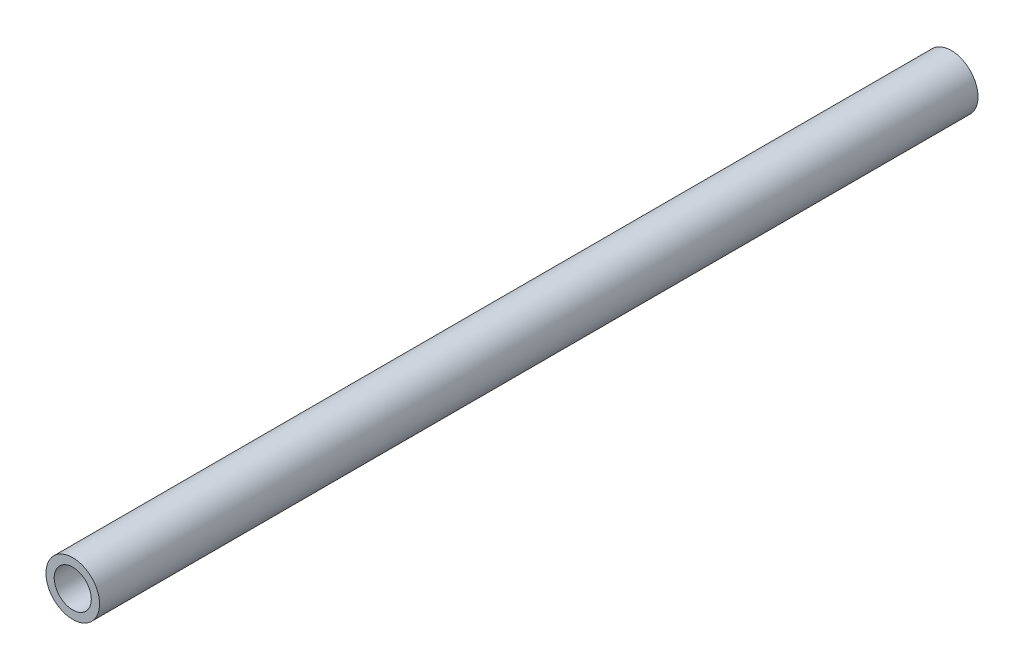
ISO-10303-21;
HEADER;
FILE_DESCRIPTION(('STEP AP214'),'2;1');
FILE_NAME('part.step','',(''),(''),'','','');
FILE_SCHEMA(('AUTOMOTIVE_DESIGN { 1 0 10303 214 1 1 1 1 }'));
ENDSEC;
DATA;
#1=APPLICATION_CONTEXT('core data for automotive mechanical design processes');
#2=APPLICATION_PROTOCOL_DEFINITION('international standard','automotive_design',2000,#1);
#3=PRODUCT_CONTEXT('',#1,'mechanical');
#4=PRODUCT('Part','Part','',(#3));
#5=PRODUCT_RELATED_PRODUCT_CATEGORY('part','',(#4));
#6=PRODUCT_DEFINITION_FORMATION('','',#4);
#7=PRODUCT_DEFINITION_CONTEXT('part definition',#1,'design');
#8=PRODUCT_DEFINITION('design','',#6,#7);
#9=PRODUCT_DEFINITION_SHAPE('','',#8);
#10=(LENGTH_UNIT() NAMED_UNIT(*) SI_UNIT(.MILLI.,.METRE.));
#11=(NAMED_UNIT(*) PLANE_ANGLE_UNIT() SI_UNIT($,.RADIAN.));
#12=(NAMED_UNIT(*) SI_UNIT($,.STERADIAN.) SOLID_ANGLE_UNIT());
#13=UNCERTAINTY_MEASURE_WITH_UNIT(LENGTH_MEASURE(1.E-05),#10,'distance_accuracy_value','');
#14=(GEOMETRIC_REPRESENTATION_CONTEXT(3) GLOBAL_UNCERTAINTY_ASSIGNED_CONTEXT((#13)) GLOBAL_UNIT_ASSIGNED_CONTEXT((#10,
#11,#12)) REPRESENTATION_CONTEXT('',''));
#15=CARTESIAN_POINT('',(0.,0.,0.));
#16=DIRECTION('',(0.,0.,1.));
#17=DIRECTION('',(1.,0.,0.));
#18=AXIS2_PLACEMENT_3D('',#15,#16,#17);
#19=CARTESIAN_POINT('',(0.,0.,254.));
#20=DIRECTION('',(0.,0.,1.));
#21=DIRECTION('',(1.,0.,0.));
#22=AXIS2_PLACEMENT_3D('',#19,#20,#21);
#23=PLANE('',#22);
#24=CARTESIAN_POINT('',(0.,0.,254.));
#25=DIRECTION('',(0.,0.,1.));
#26=DIRECTION('',(1.,0.,0.));
#27=AXIS2_PLACEMENT_3D('',#24,#25,#26);
#28=CIRCLE('',#27,7.747);
#29=CARTESIAN_POINT('',(7.747,0.,254.));
#30=VERTEX_POINT('',#29);
#31=EDGE_CURVE('E10',#30,#30,#28,.T.);
#32=ORIENTED_EDGE('',*,*,#31,.T.);
#33=EDGE_LOOP('',(#32));
#34=FACE_BOUND('',#33,.T.);
#35=CARTESIAN_POINT('',(0.,0.,254.));
#36=DIRECTION('',(0.,0.,1.));
#37=DIRECTION('',(1.,0.,0.));
#38=AXIS2_PLACEMENT_3D('',#35,#36,#37);
#39=CIRCLE('',#38,5.3594);
#40=CARTESIAN_POINT('',(5.3594,0.,254.));
#41=VERTEX_POINT('',#40);
#42=EDGE_CURVE('E41',#41,#41,#39,.T.);
#43=ORIENTED_EDGE('',*,*,#42,.F.);
#44=EDGE_LOOP('',(#43));
#45=FACE_BOUND('',#44,.T.);
#46=ADVANCED_FACE('F30',(#34,#45),#23,.T.);
#47=CARTESIAN_POINT('',(0.,0.,0.));
#48=DIRECTION('',(0.,0.,1.));
#49=DIRECTION('',(1.,0.,0.));
#50=AXIS2_PLACEMENT_3D('',#47,#48,#49);
#51=PLANE('',#50);
#52=CARTESIAN_POINT('',(0.,0.,0.));
#53=DIRECTION('',(0.,0.,1.));
#54=DIRECTION('',(1.,0.,0.));
#55=AXIS2_PLACEMENT_3D('',#52,#53,#54);
#56=CIRCLE('',#55,7.747);
#57=CARTESIAN_POINT('',(7.747,0.,0.));
#58=VERTEX_POINT('',#57);
#59=EDGE_CURVE('E34',#58,#58,#56,.T.);
#60=ORIENTED_EDGE('',*,*,#59,.F.);
#61=EDGE_LOOP('',(#60));
#62=FACE_BOUND('',#61,.T.);
#63=CARTESIAN_POINT('',(0.,0.,0.));
#64=DIRECTION('',(0.,0.,1.));
#65=DIRECTION('',(1.,0.,0.));
#66=AXIS2_PLACEMENT_3D('',#63,#64,#65);
#67=CIRCLE('',#66,5.3594);
#68=CARTESIAN_POINT('',(5.3594,0.,0.));
#69=VERTEX_POINT('',#68);
#70=EDGE_CURVE('E43',#69,#69,#67,.T.);
#71=ORIENTED_EDGE('',*,*,#70,.T.);
#72=EDGE_LOOP('',(#71));
#73=FACE_BOUND('',#72,.T.);
#74=ADVANCED_FACE('F53',(#62,#73),#51,.F.);
#75=CARTESIAN_POINT('',(0.,0.,254.));
#76=DIRECTION('',(0.,0.,-1.));
#77=DIRECTION('',(-1.,0.,0.));
#78=AXIS2_PLACEMENT_3D('',#75,#76,#77);
#79=CYLINDRICAL_SURFACE('',#78,7.747);
#80=ORIENTED_EDGE('',*,*,#31,.F.);
#81=EDGE_LOOP('',(#80));
#82=FACE_BOUND('',#81,.T.);
#83=ORIENTED_EDGE('',*,*,#59,.T.);
#84=EDGE_LOOP('',(#83));
#85=FACE_BOUND('',#84,.T.);
#86=ADVANCED_FACE('F32',(#82,#85),#79,.T.);
#87=CARTESIAN_POINT('',(0.,0.,254.));
#88=DIRECTION('',(0.,0.,-1.));
#89=DIRECTION('',(-1.,0.,0.));
#90=AXIS2_PLACEMENT_3D('',#87,#88,#89);
#91=CYLINDRICAL_SURFACE('',#90,5.3594);
#92=ORIENTED_EDGE('',*,*,#42,.T.);
#93=EDGE_LOOP('',(#92));
#94=FACE_BOUND('',#93,.T.);
#95=ORIENTED_EDGE('',*,*,#70,.F.);
#96=EDGE_LOOP('',(#95));
#97=FACE_BOUND('',#96,.T.);
#98=ADVANCED_FACE('F49',(#94,#97),#91,.F.);
#99=CLOSED_SHELL('',(#46,#74,#86,#98));
#100=MANIFOLD_SOLID_BREP('B2',#99);
#101=ADVANCED_BREP_SHAPE_REPRESENTATION('',(#18,#100),#14);
#102=SHAPE_DEFINITION_REPRESENTATION(#9,#101);
ENDSEC;
END-ISO-10303-21;
